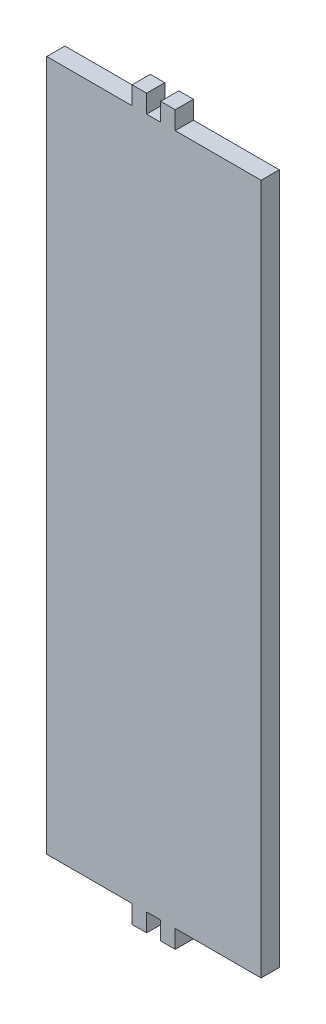
ISO-10303-21;
HEADER;
FILE_DESCRIPTION(('STEP AP214'),'2;1');
FILE_NAME('part.step','',(''),(''),'','','');
FILE_SCHEMA(('AUTOMOTIVE_DESIGN { 1 0 10303 214 1 1 1 1 }'));
ENDSEC;
DATA;
#1=APPLICATION_CONTEXT('core data for automotive mechanical design processes');
#2=APPLICATION_PROTOCOL_DEFINITION('international standard','automotive_design',2000,#1);
#3=PRODUCT_CONTEXT('',#1,'mechanical');
#4=PRODUCT('Part','Part','',(#3));
#5=PRODUCT_RELATED_PRODUCT_CATEGORY('part','',(#4));
#6=PRODUCT_DEFINITION_FORMATION('','',#4);
#7=PRODUCT_DEFINITION_CONTEXT('part definition',#1,'design');
#8=PRODUCT_DEFINITION('design','',#6,#7);
#9=PRODUCT_DEFINITION_SHAPE('','',#8);
#10=(LENGTH_UNIT() NAMED_UNIT(*) SI_UNIT(.MILLI.,.METRE.));
#11=(NAMED_UNIT(*) PLANE_ANGLE_UNIT() SI_UNIT($,.RADIAN.));
#12=(NAMED_UNIT(*) SI_UNIT($,.STERADIAN.) SOLID_ANGLE_UNIT());
#13=UNCERTAINTY_MEASURE_WITH_UNIT(LENGTH_MEASURE(1.E-05),#10,'distance_accuracy_value','');
#14=(GEOMETRIC_REPRESENTATION_CONTEXT(3) GLOBAL_UNCERTAINTY_ASSIGNED_CONTEXT((#13)) GLOBAL_UNIT_ASSIGNED_CONTEXT((#10,
#11,#12)) REPRESENTATION_CONTEXT('',''));
#15=CARTESIAN_POINT('',(0.,0.,0.));
#16=DIRECTION('',(0.,0.,1.));
#17=DIRECTION('',(1.,0.,0.));
#18=AXIS2_PLACEMENT_3D('',#15,#16,#17);
#19=CARTESIAN_POINT('',(-24.9463032,120.70314,-264.913012192349));
#20=DIRECTION('',(-1.,0.,0.));
#21=DIRECTION('',(0.,-1.,0.));
#22=AXIS2_PLACEMENT_3D('',#19,#20,#21);
#23=PLANE('',#22);
#24=DIRECTION('',(0.,1.,0.));
#25=VECTOR('',#24,1.);
#26=CARTESIAN_POINT('',(-24.9463032,120.70314,0.));
#27=LINE('',#26,#25);
#28=CARTESIAN_POINT('',(-24.9463032,-120.70314,0.));
#29=VERTEX_POINT('',#28);
#30=CARTESIAN_POINT('',(-24.9463032,120.70314,0.));
#31=VERTEX_POINT('',#30);
#32=EDGE_CURVE('E47',#29,#31,#27,.T.);
#33=ORIENTED_EDGE('',*,*,#32,.F.);
#34=DIRECTION('',(0.,0.,1.));
#35=VECTOR('',#34,1.);
#36=CARTESIAN_POINT('',(-24.9463032,-120.70314,-264.913012192349));
#37=LINE('',#36,#35);
#38=CARTESIAN_POINT('',(-24.9463032,-120.70314,6.35));
#39=VERTEX_POINT('',#38);
#40=EDGE_CURVE('E174',#29,#39,#37,.T.);
#41=ORIENTED_EDGE('',*,*,#40,.T.);
#42=DIRECTION('',(0.,-1.,0.));
#43=VECTOR('',#42,1.);
#44=CARTESIAN_POINT('',(-24.9463032,120.70314,6.35));
#45=LINE('',#44,#43);
#46=CARTESIAN_POINT('',(-24.9463032,120.70314,6.35));
#47=VERTEX_POINT('',#46);
#48=EDGE_CURVE('E178',#47,#39,#45,.T.);
#49=ORIENTED_EDGE('',*,*,#48,.F.);
#50=DIRECTION('',(0.,0.,1.));
#51=VECTOR('',#50,1.);
#52=CARTESIAN_POINT('',(-24.9463032,120.70314,-264.913012192349));
#53=LINE('',#52,#51);
#54=EDGE_CURVE('E249',#31,#47,#53,.T.);
#55=ORIENTED_EDGE('',*,*,#54,.F.);
#56=EDGE_LOOP('',(#33,#41,#49,#55));
#57=FACE_BOUND('',#56,.T.);
#58=ADVANCED_FACE('F39',(#57),#23,.T.);
#59=CARTESIAN_POINT('',(4.86502319999998,120.70314,-264.913012192349));
#60=DIRECTION('',(0.,1.,0.));
#61=DIRECTION('',(0.,0.,1.));
#62=AXIS2_PLACEMENT_3D('',#59,#60,#61);
#63=PLANE('',#62);
#64=DIRECTION('',(1.,0.,0.));
#65=VECTOR('',#64,1.);
#66=CARTESIAN_POINT('',(4.86502319999998,120.70314,0.));
#67=LINE('',#66,#65);
#68=CARTESIAN_POINT('',(4.86502319999998,120.70314,0.));
#69=VERTEX_POINT('',#68);
#70=EDGE_CURVE('E379',#31,#69,#67,.T.);
#71=ORIENTED_EDGE('',*,*,#70,.F.);
#72=ORIENTED_EDGE('',*,*,#54,.T.);
#73=DIRECTION('',(-1.,0.,0.));
#74=VECTOR('',#73,1.);
#75=CARTESIAN_POINT('',(4.86502319999998,120.70314,6.35));
#76=LINE('',#75,#74);
#77=CARTESIAN_POINT('',(4.86502319999998,120.70314,6.35));
#78=VERTEX_POINT('',#77);
#79=EDGE_CURVE('E183',#78,#47,#76,.T.);
#80=ORIENTED_EDGE('',*,*,#79,.F.);
#81=DIRECTION('',(0.,0.,1.));
#82=VECTOR('',#81,1.);
#83=CARTESIAN_POINT('',(4.86502319999998,120.70314,-264.913012192349));
#84=LINE('',#83,#82);
#85=EDGE_CURVE('E252',#69,#78,#84,.T.);
#86=ORIENTED_EDGE('',*,*,#85,.F.);
#87=EDGE_LOOP('',(#71,#72,#80,#86));
#88=FACE_BOUND('',#87,.T.);
#89=ADVANCED_FACE('F378',(#88),#63,.T.);
#90=CARTESIAN_POINT('',(4.86502319999998,127.05314,-264.913012192349));
#91=DIRECTION('',(-1.,0.,0.));
#92=DIRECTION('',(0.,0.,1.));
#93=AXIS2_PLACEMENT_3D('',#90,#91,#92);
#94=PLANE('',#93);
#95=DIRECTION('',(0.,1.,0.));
#96=VECTOR('',#95,1.);
#97=CARTESIAN_POINT('',(4.86502319999998,127.05314,0.));
#98=LINE('',#97,#96);
#99=CARTESIAN_POINT('',(4.86502319999998,127.05314,0.));
#100=VERTEX_POINT('',#99);
#101=EDGE_CURVE('E380',#69,#100,#98,.T.);
#102=ORIENTED_EDGE('',*,*,#101,.F.);
#103=ORIENTED_EDGE('',*,*,#85,.T.);
#104=DIRECTION('',(0.,-1.,0.));
#105=VECTOR('',#104,1.);
#106=CARTESIAN_POINT('',(4.86502319999998,127.05314,6.35));
#107=LINE('',#106,#105);
#108=CARTESIAN_POINT('',(4.86502319999998,127.05314,6.35));
#109=VERTEX_POINT('',#108);
#110=EDGE_CURVE('E246',#109,#78,#107,.T.);
#111=ORIENTED_EDGE('',*,*,#110,.F.);
#112=DIRECTION('',(0.,0.,1.));
#113=VECTOR('',#112,1.);
#114=CARTESIAN_POINT('',(4.86502319999998,127.05314,-264.913012192349));
#115=LINE('',#114,#113);
#116=EDGE_CURVE('E254',#100,#109,#115,.T.);
#117=ORIENTED_EDGE('',*,*,#116,.F.);
#118=EDGE_LOOP('',(#102,#103,#111,#117));
#119=FACE_BOUND('',#118,.T.);
#120=ADVANCED_FACE('F374',(#119),#94,.T.);
#121=CARTESIAN_POINT('',(9.94630319999998,127.05314,-264.913012192349));
#122=DIRECTION('',(0.,1.,0.));
#123=DIRECTION('',(-1.,0.,0.));
#124=AXIS2_PLACEMENT_3D('',#121,#122,#123);
#125=PLANE('',#124);
#126=DIRECTION('',(1.,0.,0.));
#127=VECTOR('',#126,1.);
#128=CARTESIAN_POINT('',(9.94630319999998,127.05314,0.));
#129=LINE('',#128,#127);
#130=CARTESIAN_POINT('',(9.94630319999998,127.05314,0.));
#131=VERTEX_POINT('',#130);
#132=EDGE_CURVE('E371',#100,#131,#129,.T.);
#133=ORIENTED_EDGE('',*,*,#132,.F.);
#134=ORIENTED_EDGE('',*,*,#116,.T.);
#135=DIRECTION('',(-1.,0.,0.));
#136=VECTOR('',#135,1.);
#137=CARTESIAN_POINT('',(9.94630319999998,127.05314,6.35));
#138=LINE('',#137,#136);
#139=CARTESIAN_POINT('',(9.94630319999998,127.05314,6.35));
#140=VERTEX_POINT('',#139);
#141=EDGE_CURVE('E243',#140,#109,#138,.T.);
#142=ORIENTED_EDGE('',*,*,#141,.F.);
#143=DIRECTION('',(0.,0.,1.));
#144=VECTOR('',#143,1.);
#145=CARTESIAN_POINT('',(9.94630319999998,127.05314,-264.913012192349));
#146=LINE('',#145,#144);
#147=EDGE_CURVE('E256',#131,#140,#146,.T.);
#148=ORIENTED_EDGE('',*,*,#147,.F.);
#149=EDGE_LOOP('',(#133,#134,#142,#148));
#150=FACE_BOUND('',#149,.T.);
#151=ADVANCED_FACE('F368',(#150),#125,.T.);
#152=CARTESIAN_POINT('',(9.94630319999998,120.70314,-264.913012192349));
#153=DIRECTION('',(1.,0.,0.));
#154=DIRECTION('',(0.,0.,-1.));
#155=AXIS2_PLACEMENT_3D('',#152,#153,#154);
#156=PLANE('',#155);
#157=DIRECTION('',(0.,-1.,0.));
#158=VECTOR('',#157,1.);
#159=CARTESIAN_POINT('',(9.94630319999998,120.70314,0.));
#160=LINE('',#159,#158);
#161=CARTESIAN_POINT('',(9.94630319999998,120.70314,0.));
#162=VERTEX_POINT('',#161);
#163=EDGE_CURVE('E365',#131,#162,#160,.T.);
#164=ORIENTED_EDGE('',*,*,#163,.F.);
#165=ORIENTED_EDGE('',*,*,#147,.T.);
#166=DIRECTION('',(0.,1.,0.));
#167=VECTOR('',#166,1.);
#168=CARTESIAN_POINT('',(9.94630319999998,120.70314,6.35));
#169=LINE('',#168,#167);
#170=CARTESIAN_POINT('',(9.94630319999998,120.70314,6.35));
#171=VERTEX_POINT('',#170);
#172=EDGE_CURVE('E240',#171,#140,#169,.T.);
#173=ORIENTED_EDGE('',*,*,#172,.F.);
#174=DIRECTION('',(0.,0.,1.));
#175=VECTOR('',#174,1.);
#176=CARTESIAN_POINT('',(9.94630319999998,120.70314,-264.913012192349));
#177=LINE('',#176,#175);
#178=EDGE_CURVE('E258',#162,#171,#177,.T.);
#179=ORIENTED_EDGE('',*,*,#178,.F.);
#180=EDGE_LOOP('',(#164,#165,#173,#179));
#181=FACE_BOUND('',#180,.T.);
#182=ADVANCED_FACE('F363',(#181),#156,.T.);
#183=CARTESIAN_POINT('',(14.8650232,120.70314,-264.913012192349));
#184=DIRECTION('',(0.,1.,0.));
#185=DIRECTION('',(0.,0.,1.));
#186=AXIS2_PLACEMENT_3D('',#183,#184,#185);
#187=PLANE('',#186);
#188=DIRECTION('',(1.,0.,0.));
#189=VECTOR('',#188,1.);
#190=CARTESIAN_POINT('',(14.8650232,120.70314,0.));
#191=LINE('',#190,#189);
#192=CARTESIAN_POINT('',(14.8650232,120.70314,0.));
#193=VERTEX_POINT('',#192);
#194=EDGE_CURVE('E385',#162,#193,#191,.T.);
#195=ORIENTED_EDGE('',*,*,#194,.F.);
#196=ORIENTED_EDGE('',*,*,#178,.T.);
#197=DIRECTION('',(-1.,0.,0.));
#198=VECTOR('',#197,1.);
#199=CARTESIAN_POINT('',(14.8650232,120.70314,6.35));
#200=LINE('',#199,#198);
#201=CARTESIAN_POINT('',(14.8650232,120.70314,6.35));
#202=VERTEX_POINT('',#201);
#203=EDGE_CURVE('E237',#202,#171,#200,.T.);
#204=ORIENTED_EDGE('',*,*,#203,.F.);
#205=DIRECTION('',(0.,0.,1.));
#206=VECTOR('',#205,1.);
#207=CARTESIAN_POINT('',(14.8650232,120.70314,-264.913012192349));
#208=LINE('',#207,#206);
#209=EDGE_CURVE('E260',#193,#202,#208,.T.);
#210=ORIENTED_EDGE('',*,*,#209,.F.);
#211=EDGE_LOOP('',(#195,#196,#204,#210));
#212=FACE_BOUND('',#211,.T.);
#213=ADVANCED_FACE('F357',(#212),#187,.T.);
#214=CARTESIAN_POINT('',(14.8650232,127.05314,-264.913012192349));
#215=DIRECTION('',(-1.,0.,0.));
#216=DIRECTION('',(0.,0.,1.));
#217=AXIS2_PLACEMENT_3D('',#214,#215,#216);
#218=PLANE('',#217);
#219=DIRECTION('',(0.,1.,0.));
#220=VECTOR('',#219,1.);
#221=CARTESIAN_POINT('',(14.8650232,127.05314,0.));
#222=LINE('',#221,#220);
#223=CARTESIAN_POINT('',(14.8650232,127.05314,0.));
#224=VERTEX_POINT('',#223);
#225=EDGE_CURVE('E354',#193,#224,#222,.T.);
#226=ORIENTED_EDGE('',*,*,#225,.F.);
#227=ORIENTED_EDGE('',*,*,#209,.T.);
#228=DIRECTION('',(0.,-1.,0.));
#229=VECTOR('',#228,1.);
#230=CARTESIAN_POINT('',(14.8650232,127.05314,6.35));
#231=LINE('',#230,#229);
#232=CARTESIAN_POINT('',(14.8650232,127.05314,6.35));
#233=VERTEX_POINT('',#232);
#234=EDGE_CURVE('E234',#233,#202,#231,.T.);
#235=ORIENTED_EDGE('',*,*,#234,.F.);
#236=DIRECTION('',(0.,0.,1.));
#237=VECTOR('',#236,1.);
#238=CARTESIAN_POINT('',(14.8650232,127.05314,-264.913012192349));
#239=LINE('',#238,#237);
#240=EDGE_CURVE('E262',#224,#233,#239,.T.);
#241=ORIENTED_EDGE('',*,*,#240,.F.);
#242=EDGE_LOOP('',(#226,#227,#235,#241));
#243=FACE_BOUND('',#242,.T.);
#244=ADVANCED_FACE('F351',(#243),#218,.T.);
#245=CARTESIAN_POINT('',(19.9463032,127.05314,-264.913012192349));
#246=DIRECTION('',(0.,1.,0.));
#247=DIRECTION('',(0.,0.,1.));
#248=AXIS2_PLACEMENT_3D('',#245,#246,#247);
#249=PLANE('',#248);
#250=DIRECTION('',(1.,0.,0.));
#251=VECTOR('',#250,1.);
#252=CARTESIAN_POINT('',(19.9463032,127.05314,0.));
#253=LINE('',#252,#251);
#254=CARTESIAN_POINT('',(19.9463032,127.05314,0.));
#255=VERTEX_POINT('',#254);
#256=EDGE_CURVE('E348',#224,#255,#253,.T.);
#257=ORIENTED_EDGE('',*,*,#256,.F.);
#258=ORIENTED_EDGE('',*,*,#240,.T.);
#259=DIRECTION('',(-1.,0.,0.));
#260=VECTOR('',#259,1.);
#261=CARTESIAN_POINT('',(19.9463032,127.05314,6.35));
#262=LINE('',#261,#260);
#263=CARTESIAN_POINT('',(19.9463032,127.05314,6.35));
#264=VERTEX_POINT('',#263);
#265=EDGE_CURVE('E231',#264,#233,#262,.T.);
#266=ORIENTED_EDGE('',*,*,#265,.F.);
#267=DIRECTION('',(0.,0.,1.));
#268=VECTOR('',#267,1.);
#269=CARTESIAN_POINT('',(19.9463032,127.05314,-264.913012192349));
#270=LINE('',#269,#268);
#271=EDGE_CURVE('E264',#255,#264,#270,.T.);
#272=ORIENTED_EDGE('',*,*,#271,.F.);
#273=EDGE_LOOP('',(#257,#258,#266,#272));
#274=FACE_BOUND('',#273,.T.);
#275=ADVANCED_FACE('F346',(#274),#249,.T.);
#276=CARTESIAN_POINT('',(19.9463032,120.70314,-264.913012192349));
#277=DIRECTION('',(1.,0.,0.));
#278=DIRECTION('',(0.,1.,0.));
#279=AXIS2_PLACEMENT_3D('',#276,#277,#278);
#280=PLANE('',#279);
#281=DIRECTION('',(0.,-1.,0.));
#282=VECTOR('',#281,1.);
#283=CARTESIAN_POINT('',(19.9463032,120.70314,0.));
#284=LINE('',#283,#282);
#285=CARTESIAN_POINT('',(19.9463032,120.70314,0.));
#286=VERTEX_POINT('',#285);
#287=EDGE_CURVE('E389',#255,#286,#284,.T.);
#288=ORIENTED_EDGE('',*,*,#287,.F.);
#289=ORIENTED_EDGE('',*,*,#271,.T.);
#290=DIRECTION('',(0.,1.,0.));
#291=VECTOR('',#290,1.);
#292=CARTESIAN_POINT('',(19.9463032,120.70314,6.35));
#293=LINE('',#292,#291);
#294=CARTESIAN_POINT('',(19.9463032,120.70314,6.35));
#295=VERTEX_POINT('',#294);
#296=EDGE_CURVE('E228',#295,#264,#293,.T.);
#297=ORIENTED_EDGE('',*,*,#296,.F.);
#298=DIRECTION('',(0.,0.,1.));
#299=VECTOR('',#298,1.);
#300=CARTESIAN_POINT('',(19.9463032,120.70314,-264.913012192349));
#301=LINE('',#300,#299);
#302=EDGE_CURVE('E266',#286,#295,#301,.T.);
#303=ORIENTED_EDGE('',*,*,#302,.F.);
#304=EDGE_LOOP('',(#288,#289,#297,#303));
#305=FACE_BOUND('',#304,.T.);
#306=ADVANCED_FACE('F340',(#305),#280,.T.);
#307=CARTESIAN_POINT('',(49.9463032,120.70314,-264.913012192349));
#308=DIRECTION('',(0.,1.,0.));
#309=DIRECTION('',(0.,0.,1.));
#310=AXIS2_PLACEMENT_3D('',#307,#308,#309);
#311=PLANE('',#310);
#312=DIRECTION('',(1.,0.,0.));
#313=VECTOR('',#312,1.);
#314=CARTESIAN_POINT('',(49.9463032,120.70314,0.));
#315=LINE('',#314,#313);
#316=CARTESIAN_POINT('',(49.9463032,120.70314,0.));
#317=VERTEX_POINT('',#316);
#318=EDGE_CURVE('E337',#286,#317,#315,.T.);
#319=ORIENTED_EDGE('',*,*,#318,.F.);
#320=ORIENTED_EDGE('',*,*,#302,.T.);
#321=DIRECTION('',(-1.,0.,0.));
#322=VECTOR('',#321,1.);
#323=CARTESIAN_POINT('',(49.9463032,120.70314,6.35));
#324=LINE('',#323,#322);
#325=CARTESIAN_POINT('',(49.9463032,120.70314,6.35));
#326=VERTEX_POINT('',#325);
#327=EDGE_CURVE('E225',#326,#295,#324,.T.);
#328=ORIENTED_EDGE('',*,*,#327,.F.);
#329=DIRECTION('',(0.,0.,1.));
#330=VECTOR('',#329,1.);
#331=CARTESIAN_POINT('',(49.9463032,120.70314,-264.913012192349));
#332=LINE('',#331,#330);
#333=EDGE_CURVE('E268',#317,#326,#332,.T.);
#334=ORIENTED_EDGE('',*,*,#333,.F.);
#335=EDGE_LOOP('',(#319,#320,#328,#334));
#336=FACE_BOUND('',#335,.T.);
#337=ADVANCED_FACE('F334',(#336),#311,.T.);
#338=CARTESIAN_POINT('',(49.9463032,-120.70314,-264.913012192349));
#339=DIRECTION('',(1.,0.,0.));
#340=DIRECTION('',(0.,1.,0.));
#341=AXIS2_PLACEMENT_3D('',#338,#339,#340);
#342=PLANE('',#341);
#343=DIRECTION('',(0.,-1.,0.));
#344=VECTOR('',#343,1.);
#345=CARTESIAN_POINT('',(49.9463032,-120.70314,0.));
#346=LINE('',#345,#344);
#347=CARTESIAN_POINT('',(49.9463032,-120.70314,0.));
#348=VERTEX_POINT('',#347);
#349=EDGE_CURVE('E331',#317,#348,#346,.T.);
#350=ORIENTED_EDGE('',*,*,#349,.F.);
#351=ORIENTED_EDGE('',*,*,#333,.T.);
#352=DIRECTION('',(0.,1.,0.));
#353=VECTOR('',#352,1.);
#354=CARTESIAN_POINT('',(49.9463032,-120.70314,6.35));
#355=LINE('',#354,#353);
#356=CARTESIAN_POINT('',(49.9463032,-120.70314,6.35));
#357=VERTEX_POINT('',#356);
#358=EDGE_CURVE('E222',#357,#326,#355,.T.);
#359=ORIENTED_EDGE('',*,*,#358,.F.);
#360=DIRECTION('',(0.,0.,1.));
#361=VECTOR('',#360,1.);
#362=CARTESIAN_POINT('',(49.9463032,-120.70314,-264.913012192349));
#363=LINE('',#362,#361);
#364=EDGE_CURVE('E270',#348,#357,#363,.T.);
#365=ORIENTED_EDGE('',*,*,#364,.F.);
#366=EDGE_LOOP('',(#350,#351,#359,#365));
#367=FACE_BOUND('',#366,.T.);
#368=ADVANCED_FACE('F329',(#367),#342,.T.);
#369=CARTESIAN_POINT('',(19.9463032,-120.70314,-264.913012192349));
#370=DIRECTION('',(0.,-1.,0.));
#371=DIRECTION('',(0.,0.,-1.));
#372=AXIS2_PLACEMENT_3D('',#369,#370,#371);
#373=PLANE('',#372);
#374=DIRECTION('',(-1.,0.,0.));
#375=VECTOR('',#374,1.);
#376=CARTESIAN_POINT('',(19.9463032,-120.70314,0.));
#377=LINE('',#376,#375);
#378=CARTESIAN_POINT('',(19.9463032,-120.70314,0.));
#379=VERTEX_POINT('',#378);
#380=EDGE_CURVE('E393',#348,#379,#377,.T.);
#381=ORIENTED_EDGE('',*,*,#380,.F.);
#382=ORIENTED_EDGE('',*,*,#364,.T.);
#383=DIRECTION('',(1.,0.,0.));
#384=VECTOR('',#383,1.);
#385=CARTESIAN_POINT('',(19.9463032,-120.70314,6.35));
#386=LINE('',#385,#384);
#387=CARTESIAN_POINT('',(19.9463032,-120.70314,6.35));
#388=VERTEX_POINT('',#387);
#389=EDGE_CURVE('E219',#388,#357,#386,.T.);
#390=ORIENTED_EDGE('',*,*,#389,.F.);
#391=DIRECTION('',(0.,0.,1.));
#392=VECTOR('',#391,1.);
#393=CARTESIAN_POINT('',(19.9463032,-120.70314,-264.913012192349));
#394=LINE('',#393,#392);
#395=EDGE_CURVE('E272',#379,#388,#394,.T.);
#396=ORIENTED_EDGE('',*,*,#395,.F.);
#397=EDGE_LOOP('',(#381,#382,#390,#396));
#398=FACE_BOUND('',#397,.T.);
#399=ADVANCED_FACE('F323',(#398),#373,.T.);
#400=CARTESIAN_POINT('',(19.9463032,-127.05314,-264.913012192349));
#401=DIRECTION('',(1.,0.,0.));
#402=DIRECTION('',(0.,0.,-1.));
#403=AXIS2_PLACEMENT_3D('',#400,#401,#402);
#404=PLANE('',#403);
#405=DIRECTION('',(0.,-1.,0.));
#406=VECTOR('',#405,1.);
#407=CARTESIAN_POINT('',(19.9463032,-127.05314,0.));
#408=LINE('',#407,#406);
#409=CARTESIAN_POINT('',(19.9463032,-127.05314,0.));
#410=VERTEX_POINT('',#409);
#411=EDGE_CURVE('E320',#379,#410,#408,.T.);
#412=ORIENTED_EDGE('',*,*,#411,.F.);
#413=ORIENTED_EDGE('',*,*,#395,.T.);
#414=DIRECTION('',(0.,1.,0.));
#415=VECTOR('',#414,1.);
#416=CARTESIAN_POINT('',(19.9463032,-127.05314,6.35));
#417=LINE('',#416,#415);
#418=CARTESIAN_POINT('',(19.9463032,-127.05314,6.35));
#419=VERTEX_POINT('',#418);
#420=EDGE_CURVE('E216',#419,#388,#417,.T.);
#421=ORIENTED_EDGE('',*,*,#420,.F.);
#422=DIRECTION('',(0.,0.,1.));
#423=VECTOR('',#422,1.);
#424=CARTESIAN_POINT('',(19.9463032,-127.05314,-264.913012192349));
#425=LINE('',#424,#423);
#426=EDGE_CURVE('E274',#410,#419,#425,.T.);
#427=ORIENTED_EDGE('',*,*,#426,.F.);
#428=EDGE_LOOP('',(#412,#413,#421,#427));
#429=FACE_BOUND('',#428,.T.);
#430=ADVANCED_FACE('F317',(#429),#404,.T.);
#431=CARTESIAN_POINT('',(14.8650232,-127.05314,-264.913012192349));
#432=DIRECTION('',(0.,-1.,0.));
#433=DIRECTION('',(0.,0.,-1.));
#434=AXIS2_PLACEMENT_3D('',#431,#432,#433);
#435=PLANE('',#434);
#436=DIRECTION('',(-1.,0.,0.));
#437=VECTOR('',#436,1.);
#438=CARTESIAN_POINT('',(14.8650232,-127.05314,0.));
#439=LINE('',#438,#437);
#440=CARTESIAN_POINT('',(14.8650232,-127.05314,0.));
#441=VERTEX_POINT('',#440);
#442=EDGE_CURVE('E314',#410,#441,#439,.T.);
#443=ORIENTED_EDGE('',*,*,#442,.F.);
#444=ORIENTED_EDGE('',*,*,#426,.T.);
#445=DIRECTION('',(1.,0.,0.));
#446=VECTOR('',#445,1.);
#447=CARTESIAN_POINT('',(14.8650232,-127.05314,6.35));
#448=LINE('',#447,#446);
#449=CARTESIAN_POINT('',(14.8650232,-127.05314,6.35));
#450=VERTEX_POINT('',#449);
#451=EDGE_CURVE('E213',#450,#419,#448,.T.);
#452=ORIENTED_EDGE('',*,*,#451,.F.);
#453=DIRECTION('',(0.,0.,1.));
#454=VECTOR('',#453,1.);
#455=CARTESIAN_POINT('',(14.8650232,-127.05314,-264.913012192349));
#456=LINE('',#455,#454);
#457=EDGE_CURVE('E276',#441,#450,#456,.T.);
#458=ORIENTED_EDGE('',*,*,#457,.F.);
#459=EDGE_LOOP('',(#443,#444,#452,#458));
#460=FACE_BOUND('',#459,.T.);
#461=ADVANCED_FACE('F312',(#460),#435,.T.);
#462=CARTESIAN_POINT('',(14.8650232,-120.70314,-264.913012192349));
#463=DIRECTION('',(-1.,0.,0.));
#464=DIRECTION('',(0.,0.,1.));
#465=AXIS2_PLACEMENT_3D('',#462,#463,#464);
#466=PLANE('',#465);
#467=DIRECTION('',(0.,1.,0.));
#468=VECTOR('',#467,1.);
#469=CARTESIAN_POINT('',(14.8650232,-120.70314,0.));
#470=LINE('',#469,#468);
#471=CARTESIAN_POINT('',(14.8650232,-120.70314,0.));
#472=VERTEX_POINT('',#471);
#473=EDGE_CURVE('E397',#441,#472,#470,.T.);
#474=ORIENTED_EDGE('',*,*,#473,.F.);
#475=ORIENTED_EDGE('',*,*,#457,.T.);
#476=DIRECTION('',(0.,-1.,0.));
#477=VECTOR('',#476,1.);
#478=CARTESIAN_POINT('',(14.8650232,-120.70314,6.35));
#479=LINE('',#478,#477);
#480=CARTESIAN_POINT('',(14.8650232,-120.70314,6.35));
#481=VERTEX_POINT('',#480);
#482=EDGE_CURVE('E210',#481,#450,#479,.T.);
#483=ORIENTED_EDGE('',*,*,#482,.F.);
#484=DIRECTION('',(0.,0.,1.));
#485=VECTOR('',#484,1.);
#486=CARTESIAN_POINT('',(14.8650232,-120.70314,-264.913012192349));
#487=LINE('',#486,#485);
#488=EDGE_CURVE('E278',#472,#481,#487,.T.);
#489=ORIENTED_EDGE('',*,*,#488,.F.);
#490=EDGE_LOOP('',(#474,#475,#483,#489));
#491=FACE_BOUND('',#490,.T.);
#492=ADVANCED_FACE('F306',(#491),#466,.T.);
#493=CARTESIAN_POINT('',(9.94630320000001,-120.70314,-264.913012192349));
#494=DIRECTION('',(0.,-1.,0.));
#495=DIRECTION('',(0.,0.,-1.));
#496=AXIS2_PLACEMENT_3D('',#493,#494,#495);
#497=PLANE('',#496);
#498=DIRECTION('',(-1.,0.,0.));
#499=VECTOR('',#498,1.);
#500=CARTESIAN_POINT('',(9.94630320000001,-120.70314,0.));
#501=LINE('',#500,#499);
#502=CARTESIAN_POINT('',(9.94630320000001,-120.70314,0.));
#503=VERTEX_POINT('',#502);
#504=EDGE_CURVE('E303',#472,#503,#501,.T.);
#505=ORIENTED_EDGE('',*,*,#504,.F.);
#506=ORIENTED_EDGE('',*,*,#488,.T.);
#507=DIRECTION('',(1.,0.,0.));
#508=VECTOR('',#507,1.);
#509=CARTESIAN_POINT('',(9.94630320000001,-120.70314,6.35));
#510=LINE('',#509,#508);
#511=CARTESIAN_POINT('',(9.94630320000001,-120.70314,6.35));
#512=VERTEX_POINT('',#511);
#513=EDGE_CURVE('E207',#512,#481,#510,.T.);
#514=ORIENTED_EDGE('',*,*,#513,.F.);
#515=DIRECTION('',(0.,0.,1.));
#516=VECTOR('',#515,1.);
#517=CARTESIAN_POINT('',(9.94630320000001,-120.70314,-264.913012192349));
#518=LINE('',#517,#516);
#519=EDGE_CURVE('E280',#503,#512,#518,.T.);
#520=ORIENTED_EDGE('',*,*,#519,.F.);
#521=EDGE_LOOP('',(#505,#506,#514,#520));
#522=FACE_BOUND('',#521,.T.);
#523=ADVANCED_FACE('F300',(#522),#497,.T.);
#524=CARTESIAN_POINT('',(9.94630320000001,-127.05314,-264.913012192349));
#525=DIRECTION('',(1.,0.,0.));
#526=DIRECTION('',(0.,1.,0.));
#527=AXIS2_PLACEMENT_3D('',#524,#525,#526);
#528=PLANE('',#527);
#529=DIRECTION('',(0.,-1.,0.));
#530=VECTOR('',#529,1.);
#531=CARTESIAN_POINT('',(9.94630320000001,-127.05314,0.));
#532=LINE('',#531,#530);
#533=CARTESIAN_POINT('',(9.94630320000001,-127.05314,0.));
#534=VERTEX_POINT('',#533);
#535=EDGE_CURVE('E59',#503,#534,#532,.T.);
#536=ORIENTED_EDGE('',*,*,#535,.F.);
#537=ORIENTED_EDGE('',*,*,#519,.T.);
#538=DIRECTION('',(0.,1.,0.));
#539=VECTOR('',#538,1.);
#540=CARTESIAN_POINT('',(9.94630320000001,-127.05314,6.35));
#541=LINE('',#540,#539);
#542=CARTESIAN_POINT('',(9.94630320000001,-127.05314,6.35));
#543=VERTEX_POINT('',#542);
#544=EDGE_CURVE('E204',#543,#512,#541,.T.);
#545=ORIENTED_EDGE('',*,*,#544,.F.);
#546=DIRECTION('',(0.,0.,1.));
#547=VECTOR('',#546,1.);
#548=CARTESIAN_POINT('',(9.94630320000001,-127.05314,-264.913012192349));
#549=LINE('',#548,#547);
#550=EDGE_CURVE('E282',#534,#543,#549,.T.);
#551=ORIENTED_EDGE('',*,*,#550,.F.);
#552=EDGE_LOOP('',(#536,#537,#545,#551));
#553=FACE_BOUND('',#552,.T.);
#554=ADVANCED_FACE('F296',(#553),#528,.T.);
#555=CARTESIAN_POINT('',(4.86502320000001,-127.05314,-264.913012192349));
#556=DIRECTION('',(0.,-1.,0.));
#557=DIRECTION('',(1.,0.,0.));
#558=AXIS2_PLACEMENT_3D('',#555,#556,#557);
#559=PLANE('',#558);
#560=DIRECTION('',(-1.,0.,0.));
#561=VECTOR('',#560,1.);
#562=CARTESIAN_POINT('',(4.86502320000001,-127.05314,0.));
#563=LINE('',#562,#561);
#564=CARTESIAN_POINT('',(4.86502320000001,-127.05314,0.));
#565=VERTEX_POINT('',#564);
#566=EDGE_CURVE('E54',#534,#565,#563,.T.);
#567=ORIENTED_EDGE('',*,*,#566,.F.);
#568=ORIENTED_EDGE('',*,*,#550,.T.);
#569=DIRECTION('',(1.,0.,0.));
#570=VECTOR('',#569,1.);
#571=CARTESIAN_POINT('',(4.86502320000001,-127.05314,6.35));
#572=LINE('',#571,#570);
#573=CARTESIAN_POINT('',(4.86502320000001,-127.05314,6.35));
#574=VERTEX_POINT('',#573);
#575=EDGE_CURVE('E201',#574,#543,#572,.T.);
#576=ORIENTED_EDGE('',*,*,#575,.F.);
#577=DIRECTION('',(0.,0.,1.));
#578=VECTOR('',#577,1.);
#579=CARTESIAN_POINT('',(4.86502320000001,-127.05314,-264.913012192349));
#580=LINE('',#579,#578);
#581=EDGE_CURVE('E284',#565,#574,#580,.T.);
#582=ORIENTED_EDGE('',*,*,#581,.F.);
#583=EDGE_LOOP('',(#567,#568,#576,#582));
#584=FACE_BOUND('',#583,.T.);
#585=ADVANCED_FACE('F291',(#584),#559,.T.);
#586=CARTESIAN_POINT('',(4.86502320000001,-120.70314,-264.913012192349));
#587=DIRECTION('',(-1.,0.,0.));
#588=DIRECTION('',(0.,-1.,0.));
#589=AXIS2_PLACEMENT_3D('',#586,#587,#588);
#590=PLANE('',#589);
#591=DIRECTION('',(0.,1.,0.));
#592=VECTOR('',#591,1.);
#593=CARTESIAN_POINT('',(4.86502320000001,-120.70314,0.));
#594=LINE('',#593,#592);
#595=CARTESIAN_POINT('',(4.86502320000001,-120.70314,0.));
#596=VERTEX_POINT('',#595);
#597=EDGE_CURVE('E251',#565,#596,#594,.T.);
#598=ORIENTED_EDGE('',*,*,#597,.F.);
#599=ORIENTED_EDGE('',*,*,#581,.T.);
#600=DIRECTION('',(0.,-1.,0.));
#601=VECTOR('',#600,1.);
#602=CARTESIAN_POINT('',(4.86502320000001,-120.70314,6.35));
#603=LINE('',#602,#601);
#604=CARTESIAN_POINT('',(4.86502320000001,-120.70314,6.35));
#605=VERTEX_POINT('',#604);
#606=EDGE_CURVE('E191',#605,#574,#603,.T.);
#607=ORIENTED_EDGE('',*,*,#606,.F.);
#608=DIRECTION('',(0.,0.,1.));
#609=VECTOR('',#608,1.);
#610=CARTESIAN_POINT('',(4.86502320000001,-120.70314,-264.913012192349));
#611=LINE('',#610,#609);
#612=EDGE_CURVE('E182',#596,#605,#611,.T.);
#613=ORIENTED_EDGE('',*,*,#612,.F.);
#614=EDGE_LOOP('',(#598,#599,#607,#613));
#615=FACE_BOUND('',#614,.T.);
#616=ADVANCED_FACE('F289',(#615),#590,.T.);
#617=CARTESIAN_POINT('',(-24.9463032,-120.70314,-264.913012192349));
#618=DIRECTION('',(0.,-1.,0.));
#619=DIRECTION('',(0.,0.,-1.));
#620=AXIS2_PLACEMENT_3D('',#617,#618,#619);
#621=PLANE('',#620);
#622=DIRECTION('',(-1.,0.,0.));
#623=VECTOR('',#622,1.);
#624=CARTESIAN_POINT('',(-24.9463032,-120.70314,0.));
#625=LINE('',#624,#623);
#626=EDGE_CURVE('E11',#596,#29,#625,.T.);
#627=ORIENTED_EDGE('',*,*,#626,.F.);
#628=ORIENTED_EDGE('',*,*,#612,.T.);
#629=DIRECTION('',(1.,0.,0.));
#630=VECTOR('',#629,1.);
#631=CARTESIAN_POINT('',(-24.9463032,-120.70314,6.35));
#632=LINE('',#631,#630);
#633=EDGE_CURVE('E185',#39,#605,#632,.T.);
#634=ORIENTED_EDGE('',*,*,#633,.F.);
#635=ORIENTED_EDGE('',*,*,#40,.F.);
#636=EDGE_LOOP('',(#627,#628,#634,#635));
#637=FACE_BOUND('',#636,.T.);
#638=ADVANCED_FACE('F186',(#637),#621,.T.);
#639=CARTESIAN_POINT('',(0.,0.,0.));
#640=DIRECTION('',(0.,0.,1.));
#641=DIRECTION('',(1.,0.,0.));
#642=AXIS2_PLACEMENT_3D('',#639,#640,#641);
#643=PLANE('',#642);
#644=ORIENTED_EDGE('',*,*,#32,.T.);
#645=ORIENTED_EDGE('',*,*,#70,.T.);
#646=ORIENTED_EDGE('',*,*,#101,.T.);
#647=ORIENTED_EDGE('',*,*,#132,.T.);
#648=ORIENTED_EDGE('',*,*,#163,.T.);
#649=ORIENTED_EDGE('',*,*,#194,.T.);
#650=ORIENTED_EDGE('',*,*,#225,.T.);
#651=ORIENTED_EDGE('',*,*,#256,.T.);
#652=ORIENTED_EDGE('',*,*,#287,.T.);
#653=ORIENTED_EDGE('',*,*,#318,.T.);
#654=ORIENTED_EDGE('',*,*,#349,.T.);
#655=ORIENTED_EDGE('',*,*,#380,.T.);
#656=ORIENTED_EDGE('',*,*,#411,.T.);
#657=ORIENTED_EDGE('',*,*,#442,.T.);
#658=ORIENTED_EDGE('',*,*,#473,.T.);
#659=ORIENTED_EDGE('',*,*,#504,.T.);
#660=ORIENTED_EDGE('',*,*,#535,.T.);
#661=ORIENTED_EDGE('',*,*,#566,.T.);
#662=ORIENTED_EDGE('',*,*,#597,.T.);
#663=ORIENTED_EDGE('',*,*,#626,.T.);
#664=EDGE_LOOP('',(#644,#645,#646,#647,#648,#649,#650,#651,#652,#653,#654,#655,#656,#657,#658,
#659,#660,#661,#662,#663));
#665=FACE_BOUND('',#664,.T.);
#666=ADVANCED_FACE('F41',(#665),#643,.F.);
#667=CARTESIAN_POINT('',(0.,0.,6.35));
#668=DIRECTION('',(0.,0.,1.));
#669=DIRECTION('',(1.,0.,0.));
#670=AXIS2_PLACEMENT_3D('',#667,#668,#669);
#671=PLANE('',#670);
#672=ORIENTED_EDGE('',*,*,#48,.T.);
#673=ORIENTED_EDGE('',*,*,#633,.T.);
#674=ORIENTED_EDGE('',*,*,#606,.T.);
#675=ORIENTED_EDGE('',*,*,#575,.T.);
#676=ORIENTED_EDGE('',*,*,#544,.T.);
#677=ORIENTED_EDGE('',*,*,#513,.T.);
#678=ORIENTED_EDGE('',*,*,#482,.T.);
#679=ORIENTED_EDGE('',*,*,#451,.T.);
#680=ORIENTED_EDGE('',*,*,#420,.T.);
#681=ORIENTED_EDGE('',*,*,#389,.T.);
#682=ORIENTED_EDGE('',*,*,#358,.T.);
#683=ORIENTED_EDGE('',*,*,#327,.T.);
#684=ORIENTED_EDGE('',*,*,#296,.T.);
#685=ORIENTED_EDGE('',*,*,#265,.T.);
#686=ORIENTED_EDGE('',*,*,#234,.T.);
#687=ORIENTED_EDGE('',*,*,#203,.T.);
#688=ORIENTED_EDGE('',*,*,#172,.T.);
#689=ORIENTED_EDGE('',*,*,#141,.T.);
#690=ORIENTED_EDGE('',*,*,#110,.T.);
#691=ORIENTED_EDGE('',*,*,#79,.T.);
#692=EDGE_LOOP('',(#672,#673,#674,#675,#676,#677,#678,#679,#680,#681,#682,#683,#684,#685,#686,
#687,#688,#689,#690,#691));
#693=FACE_BOUND('',#692,.T.);
#694=ADVANCED_FACE('F193',(#693),#671,.T.);
#695=CLOSED_SHELL('',(#58,#89,#120,#151,#182,#213,#244,#275,#306,#337,#368,#399,#430,#461,#492,
#523,#554,#585,#616,#638,#666,#694));
#696=MANIFOLD_SOLID_BREP('B2',#695);
#697=ADVANCED_BREP_SHAPE_REPRESENTATION('',(#18,#696),#14);
#698=SHAPE_DEFINITION_REPRESENTATION(#9,#697);
ENDSEC;
END-ISO-10303-21;
